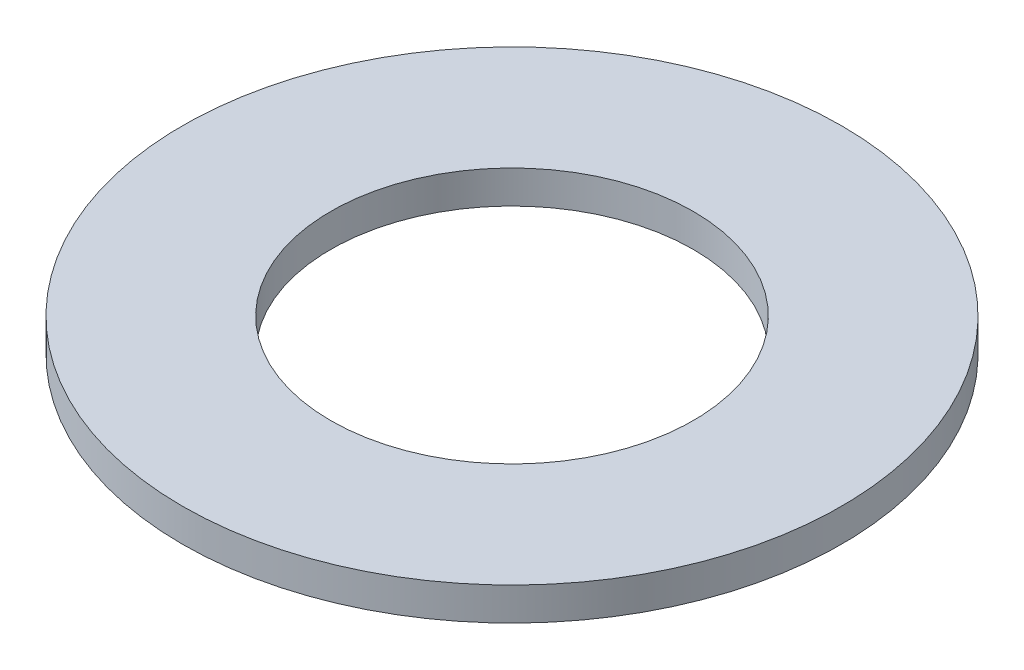
ISO-10303-21;
HEADER;
FILE_DESCRIPTION(('STEP AP214'),'2;1');
FILE_NAME('part.step','',(''),(''),'','','');
FILE_SCHEMA(('AUTOMOTIVE_DESIGN { 1 0 10303 214 1 1 1 1 }'));
ENDSEC;
DATA;
#1=APPLICATION_CONTEXT('core data for automotive mechanical design processes');
#2=APPLICATION_PROTOCOL_DEFINITION('international standard','automotive_design',2000,#1);
#3=PRODUCT_CONTEXT('',#1,'mechanical');
#4=PRODUCT('Part','Part','',(#3));
#5=PRODUCT_RELATED_PRODUCT_CATEGORY('part','',(#4));
#6=PRODUCT_DEFINITION_FORMATION('','',#4);
#7=PRODUCT_DEFINITION_CONTEXT('part definition',#1,'design');
#8=PRODUCT_DEFINITION('design','',#6,#7);
#9=PRODUCT_DEFINITION_SHAPE('','',#8);
#10=(LENGTH_UNIT() NAMED_UNIT(*) SI_UNIT(.MILLI.,.METRE.));
#11=(NAMED_UNIT(*) PLANE_ANGLE_UNIT() SI_UNIT($,.RADIAN.));
#12=(NAMED_UNIT(*) SI_UNIT($,.STERADIAN.) SOLID_ANGLE_UNIT());
#13=UNCERTAINTY_MEASURE_WITH_UNIT(LENGTH_MEASURE(1.E-05),#10,'distance_accuracy_value','');
#14=(GEOMETRIC_REPRESENTATION_CONTEXT(3) GLOBAL_UNCERTAINTY_ASSIGNED_CONTEXT((#13)) GLOBAL_UNIT_ASSIGNED_CONTEXT((#10,
#11,#12)) REPRESENTATION_CONTEXT('',''));
#15=CARTESIAN_POINT('',(0.,0.,0.));
#16=DIRECTION('',(0.,0.,1.));
#17=DIRECTION('',(1.,0.,0.));
#18=AXIS2_PLACEMENT_3D('',#15,#16,#17);
#19=CARTESIAN_POINT('',(0.,2.,0.));
#20=DIRECTION('',(0.,1.,0.));
#21=DIRECTION('',(0.,0.,1.));
#22=AXIS2_PLACEMENT_3D('',#19,#20,#21);
#23=PLANE('',#22);
#24=CARTESIAN_POINT('',(0.,2.,0.));
#25=DIRECTION('',(0.,1.,0.));
#26=DIRECTION('',(0.,0.,1.));
#27=AXIS2_PLACEMENT_3D('',#24,#25,#26);
#28=CIRCLE('',#27,20.);
#29=CARTESIAN_POINT('',(0.,2.,20.));
#30=VERTEX_POINT('',#29);
#31=EDGE_CURVE('E10',#30,#30,#28,.T.);
#32=ORIENTED_EDGE('',*,*,#31,.T.);
#33=EDGE_LOOP('',(#32));
#34=FACE_BOUND('',#33,.T.);
#35=CARTESIAN_POINT('',(0.,2.,0.));
#36=DIRECTION('',(0.,1.,0.));
#37=DIRECTION('',(0.,0.,1.));
#38=AXIS2_PLACEMENT_3D('',#35,#36,#37);
#39=CIRCLE('',#38,11.);
#40=CARTESIAN_POINT('',(0.,2.,11.));
#41=VERTEX_POINT('',#40);
#42=EDGE_CURVE('E49',#41,#41,#39,.T.);
#43=ORIENTED_EDGE('',*,*,#42,.F.);
#44=EDGE_LOOP('',(#43));
#45=FACE_BOUND('',#44,.T.);
#46=ADVANCED_FACE('F36',(#34,#45),#23,.T.);
#47=CARTESIAN_POINT('',(0.,0.,0.));
#48=DIRECTION('',(0.,1.,0.));
#49=DIRECTION('',(0.,0.,1.));
#50=AXIS2_PLACEMENT_3D('',#47,#48,#49);
#51=PLANE('',#50);
#52=CARTESIAN_POINT('',(0.,0.,0.));
#53=DIRECTION('',(0.,1.,0.));
#54=DIRECTION('',(0.,0.,1.));
#55=AXIS2_PLACEMENT_3D('',#52,#53,#54);
#56=CIRCLE('',#55,20.);
#57=CARTESIAN_POINT('',(0.,0.,20.));
#58=VERTEX_POINT('',#57);
#59=EDGE_CURVE('E40',#58,#58,#56,.T.);
#60=ORIENTED_EDGE('',*,*,#59,.F.);
#61=EDGE_LOOP('',(#60));
#62=FACE_BOUND('',#61,.T.);
#63=CARTESIAN_POINT('',(0.,0.,0.));
#64=DIRECTION('',(0.,1.,0.));
#65=DIRECTION('',(0.,0.,1.));
#66=AXIS2_PLACEMENT_3D('',#63,#64,#65);
#67=CIRCLE('',#66,11.);
#68=CARTESIAN_POINT('',(0.,0.,11.));
#69=VERTEX_POINT('',#68);
#70=EDGE_CURVE('E51',#69,#69,#67,.T.);
#71=ORIENTED_EDGE('',*,*,#70,.T.);
#72=EDGE_LOOP('',(#71));
#73=FACE_BOUND('',#72,.T.);
#74=ADVANCED_FACE('F63',(#62,#73),#51,.F.);
#75=CARTESIAN_POINT('',(0.,2.,0.));
#76=DIRECTION('',(0.,-1.,0.));
#77=DIRECTION('',(0.,0.,-1.));
#78=AXIS2_PLACEMENT_3D('',#75,#76,#77);
#79=CYLINDRICAL_SURFACE('',#78,20.);
#80=ORIENTED_EDGE('',*,*,#31,.F.);
#81=EDGE_LOOP('',(#80));
#82=FACE_BOUND('',#81,.T.);
#83=ORIENTED_EDGE('',*,*,#59,.T.);
#84=EDGE_LOOP('',(#83));
#85=FACE_BOUND('',#84,.T.);
#86=ADVANCED_FACE('F38',(#82,#85),#79,.T.);
#87=CARTESIAN_POINT('',(0.,2.,0.));
#88=DIRECTION('',(0.,-1.,0.));
#89=DIRECTION('',(0.,0.,-1.));
#90=AXIS2_PLACEMENT_3D('',#87,#88,#89);
#91=CYLINDRICAL_SURFACE('',#90,11.);
#92=ORIENTED_EDGE('',*,*,#42,.T.);
#93=EDGE_LOOP('',(#92));
#94=FACE_BOUND('',#93,.T.);
#95=ORIENTED_EDGE('',*,*,#70,.F.);
#96=EDGE_LOOP('',(#95));
#97=FACE_BOUND('',#96,.T.);
#98=ADVANCED_FACE('F59',(#94,#97),#91,.F.);
#99=CLOSED_SHELL('',(#46,#74,#86,#98));
#100=MANIFOLD_SOLID_BREP('B2',#99);
#101=ADVANCED_BREP_SHAPE_REPRESENTATION('',(#18,#100),#14);
#102=SHAPE_DEFINITION_REPRESENTATION(#9,#101);
ENDSEC;
END-ISO-10303-21;
